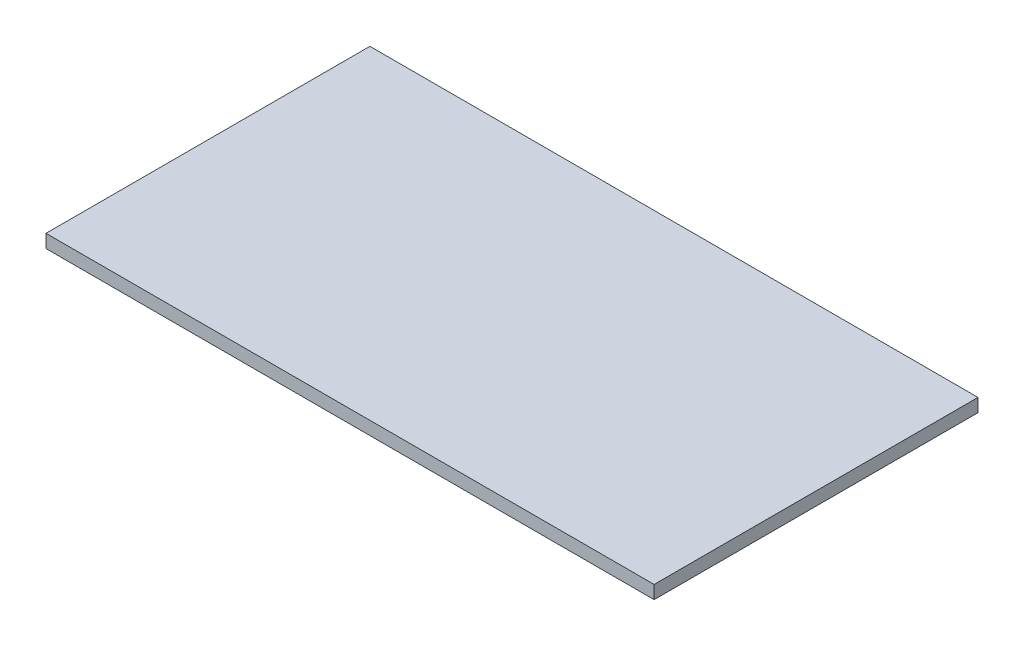
ISO-10303-21;
HEADER;
FILE_DESCRIPTION(('STEP AP214'),'2;1');
FILE_NAME('part.step','',(''),(''),'','','');
FILE_SCHEMA(('AUTOMOTIVE_DESIGN { 1 0 10303 214 1 1 1 1 }'));
ENDSEC;
DATA;
#1=APPLICATION_CONTEXT('core data for automotive mechanical design processes');
#2=APPLICATION_PROTOCOL_DEFINITION('international standard','automotive_design',2000,#1);
#3=PRODUCT_CONTEXT('',#1,'mechanical');
#4=PRODUCT('Part','Part','',(#3));
#5=PRODUCT_RELATED_PRODUCT_CATEGORY('part','',(#4));
#6=PRODUCT_DEFINITION_FORMATION('','',#4);
#7=PRODUCT_DEFINITION_CONTEXT('part definition',#1,'design');
#8=PRODUCT_DEFINITION('design','',#6,#7);
#9=PRODUCT_DEFINITION_SHAPE('','',#8);
#10=(LENGTH_UNIT() NAMED_UNIT(*) SI_UNIT(.MILLI.,.METRE.));
#11=(NAMED_UNIT(*) PLANE_ANGLE_UNIT() SI_UNIT($,.RADIAN.));
#12=(NAMED_UNIT(*) SI_UNIT($,.STERADIAN.) SOLID_ANGLE_UNIT());
#13=UNCERTAINTY_MEASURE_WITH_UNIT(LENGTH_MEASURE(1.E-05),#10,'distance_accuracy_value','');
#14=(GEOMETRIC_REPRESENTATION_CONTEXT(3) GLOBAL_UNCERTAINTY_ASSIGNED_CONTEXT((#13)) GLOBAL_UNIT_ASSIGNED_CONTEXT((#10,
#11,#12)) REPRESENTATION_CONTEXT('',''));
#15=CARTESIAN_POINT('',(0.,0.,0.));
#16=DIRECTION('',(0.,0.,1.));
#17=DIRECTION('',(1.,0.,0.));
#18=AXIS2_PLACEMENT_3D('',#15,#16,#17);
#19=CARTESIAN_POINT('',(438.15,19.05,233.3625));
#20=DIRECTION('',(-1.,0.,0.));
#21=DIRECTION('',(0.,0.,1.));
#22=AXIS2_PLACEMENT_3D('',#19,#20,#21);
#23=PLANE('',#22);
#24=DIRECTION('',(0.,0.,-1.));
#25=VECTOR('',#24,1.);
#26=CARTESIAN_POINT('',(438.15,0.,233.3625));
#27=LINE('',#26,#25);
#28=CARTESIAN_POINT('',(438.15,0.,233.3625));
#29=VERTEX_POINT('',#28);
#30=CARTESIAN_POINT('',(438.15,0.,-233.3625));
#31=VERTEX_POINT('',#30);
#32=EDGE_CURVE('E107',#29,#31,#27,.T.);
#33=ORIENTED_EDGE('',*,*,#32,.T.);
#34=DIRECTION('',(0.,-1.,0.));
#35=VECTOR('',#34,1.);
#36=CARTESIAN_POINT('',(438.15,19.05,-233.3625));
#37=LINE('',#36,#35);
#38=CARTESIAN_POINT('',(438.15,19.05,-233.3625));
#39=VERTEX_POINT('',#38);
#40=EDGE_CURVE('E11',#39,#31,#37,.T.);
#41=ORIENTED_EDGE('',*,*,#40,.F.);
#42=DIRECTION('',(0.,0.,-1.));
#43=VECTOR('',#42,1.);
#44=CARTESIAN_POINT('',(438.15,19.05,233.3625));
#45=LINE('',#44,#43);
#46=CARTESIAN_POINT('',(438.15,19.05,233.3625));
#47=VERTEX_POINT('',#46);
#48=EDGE_CURVE('E91',#47,#39,#45,.T.);
#49=ORIENTED_EDGE('',*,*,#48,.F.);
#50=DIRECTION('',(0.,-1.,0.));
#51=VECTOR('',#50,1.);
#52=CARTESIAN_POINT('',(438.15,19.05,233.3625));
#53=LINE('',#52,#51);
#54=EDGE_CURVE('E103',#47,#29,#53,.T.);
#55=ORIENTED_EDGE('',*,*,#54,.T.);
#56=EDGE_LOOP('',(#33,#41,#49,#55));
#57=FACE_BOUND('',#56,.T.);
#58=ADVANCED_FACE('F39',(#57),#23,.F.);
#59=CARTESIAN_POINT('',(-438.15,19.05,-233.3625));
#60=DIRECTION('',(0.,0.,1.));
#61=DIRECTION('',(1.,0.,0.));
#62=AXIS2_PLACEMENT_3D('',#59,#60,#61);
#63=PLANE('',#62);
#64=DIRECTION('',(-1.,0.,0.));
#65=VECTOR('',#64,1.);
#66=CARTESIAN_POINT('',(-438.15,0.,-233.3625));
#67=LINE('',#66,#65);
#68=CARTESIAN_POINT('',(-438.15,0.,-233.3625));
#69=VERTEX_POINT('',#68);
#70=EDGE_CURVE('E96',#31,#69,#67,.T.);
#71=ORIENTED_EDGE('',*,*,#70,.T.);
#72=DIRECTION('',(0.,-1.,0.));
#73=VECTOR('',#72,1.);
#74=CARTESIAN_POINT('',(-438.15,19.05,-233.3625));
#75=LINE('',#74,#73);
#76=CARTESIAN_POINT('',(-438.15,19.05,-233.3625));
#77=VERTEX_POINT('',#76);
#78=EDGE_CURVE('E48',#77,#69,#75,.T.);
#79=ORIENTED_EDGE('',*,*,#78,.F.);
#80=DIRECTION('',(-1.,0.,0.));
#81=VECTOR('',#80,1.);
#82=CARTESIAN_POINT('',(-438.15,19.05,-233.3625));
#83=LINE('',#82,#81);
#84=EDGE_CURVE('E86',#39,#77,#83,.T.);
#85=ORIENTED_EDGE('',*,*,#84,.F.);
#86=ORIENTED_EDGE('',*,*,#40,.T.);
#87=EDGE_LOOP('',(#71,#79,#85,#86));
#88=FACE_BOUND('',#87,.T.);
#89=ADVANCED_FACE('F95',(#88),#63,.F.);
#90=CARTESIAN_POINT('',(-438.15,19.05,233.3625));
#91=DIRECTION('',(1.,0.,0.));
#92=DIRECTION('',(0.,0.,-1.));
#93=AXIS2_PLACEMENT_3D('',#90,#91,#92);
#94=PLANE('',#93);
#95=DIRECTION('',(0.,0.,1.));
#96=VECTOR('',#95,1.);
#97=CARTESIAN_POINT('',(-438.15,0.,233.3625));
#98=LINE('',#97,#96);
#99=CARTESIAN_POINT('',(-438.15,0.,233.3625));
#100=VERTEX_POINT('',#99);
#101=EDGE_CURVE('E73',#69,#100,#98,.T.);
#102=ORIENTED_EDGE('',*,*,#101,.T.);
#103=DIRECTION('',(0.,-1.,0.));
#104=VECTOR('',#103,1.);
#105=CARTESIAN_POINT('',(-438.15,19.05,233.3625));
#106=LINE('',#105,#104);
#107=CARTESIAN_POINT('',(-438.15,19.05,233.3625));
#108=VERTEX_POINT('',#107);
#109=EDGE_CURVE('E98',#108,#100,#106,.T.);
#110=ORIENTED_EDGE('',*,*,#109,.F.);
#111=DIRECTION('',(0.,0.,1.));
#112=VECTOR('',#111,1.);
#113=CARTESIAN_POINT('',(-438.15,19.05,233.3625));
#114=LINE('',#113,#112);
#115=EDGE_CURVE('E89',#77,#108,#114,.T.);
#116=ORIENTED_EDGE('',*,*,#115,.F.);
#117=ORIENTED_EDGE('',*,*,#78,.T.);
#118=EDGE_LOOP('',(#102,#110,#116,#117));
#119=FACE_BOUND('',#118,.T.);
#120=ADVANCED_FACE('F99',(#119),#94,.F.);
#121=CARTESIAN_POINT('',(-438.15,19.05,233.3625));
#122=DIRECTION('',(0.,0.,-1.));
#123=DIRECTION('',(-1.,0.,0.));
#124=AXIS2_PLACEMENT_3D('',#121,#122,#123);
#125=PLANE('',#124);
#126=DIRECTION('',(1.,0.,0.));
#127=VECTOR('',#126,1.);
#128=CARTESIAN_POINT('',(-438.15,0.,233.3625));
#129=LINE('',#128,#127);
#130=EDGE_CURVE('E79',#100,#29,#129,.T.);
#131=ORIENTED_EDGE('',*,*,#130,.T.);
#132=ORIENTED_EDGE('',*,*,#54,.F.);
#133=DIRECTION('',(1.,0.,0.));
#134=VECTOR('',#133,1.);
#135=CARTESIAN_POINT('',(-438.15,19.05,233.3625));
#136=LINE('',#135,#134);
#137=EDGE_CURVE('E56',#108,#47,#136,.T.);
#138=ORIENTED_EDGE('',*,*,#137,.F.);
#139=ORIENTED_EDGE('',*,*,#109,.T.);
#140=EDGE_LOOP('',(#131,#132,#138,#139));
#141=FACE_BOUND('',#140,.T.);
#142=ADVANCED_FACE('F120',(#141),#125,.F.);
#143=CARTESIAN_POINT('',(0.,19.05,0.));
#144=DIRECTION('',(0.,-1.,0.));
#145=DIRECTION('',(0.,0.,-1.));
#146=AXIS2_PLACEMENT_3D('',#143,#144,#145);
#147=PLANE('',#146);
#148=ORIENTED_EDGE('',*,*,#48,.T.);
#149=ORIENTED_EDGE('',*,*,#84,.T.);
#150=ORIENTED_EDGE('',*,*,#115,.T.);
#151=ORIENTED_EDGE('',*,*,#137,.T.);
#152=EDGE_LOOP('',(#148,#149,#150,#151));
#153=FACE_BOUND('',#152,.T.);
#154=ADVANCED_FACE('F87',(#153),#147,.F.);
#155=CARTESIAN_POINT('',(0.,0.,0.));
#156=DIRECTION('',(0.,-1.,0.));
#157=DIRECTION('',(0.,0.,-1.));
#158=AXIS2_PLACEMENT_3D('',#155,#156,#157);
#159=PLANE('',#158);
#160=ORIENTED_EDGE('',*,*,#32,.F.);
#161=ORIENTED_EDGE('',*,*,#130,.F.);
#162=ORIENTED_EDGE('',*,*,#101,.F.);
#163=ORIENTED_EDGE('',*,*,#70,.F.);
#164=EDGE_LOOP('',(#160,#161,#162,#163));
#165=FACE_BOUND('',#164,.T.);
#166=ADVANCED_FACE('F123',(#165),#159,.T.);
#167=CLOSED_SHELL('',(#58,#89,#120,#142,#154,#166));
#168=MANIFOLD_SOLID_BREP('B2',#167);
#169=ADVANCED_BREP_SHAPE_REPRESENTATION('',(#18,#168),#14);
#170=SHAPE_DEFINITION_REPRESENTATION(#9,#169);
ENDSEC;
END-ISO-10303-21;
